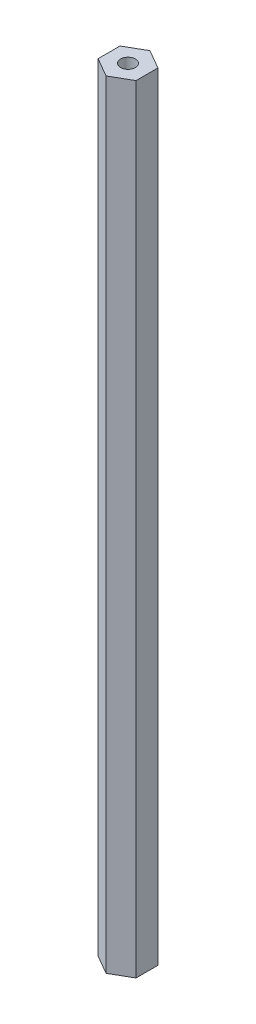
ISO-10303-21;
HEADER;
FILE_DESCRIPTION(('STEP AP214'),'2;1');
FILE_NAME('part.step','',(''),(''),'','','');
FILE_SCHEMA(('AUTOMOTIVE_DESIGN { 1 0 10303 214 1 1 1 1 }'));
ENDSEC;
DATA;
#1=APPLICATION_CONTEXT('core data for automotive mechanical design processes');
#2=APPLICATION_PROTOCOL_DEFINITION('international standard','automotive_design',2000,#1);
#3=PRODUCT_CONTEXT('',#1,'mechanical');
#4=PRODUCT('Part','Part','',(#3));
#5=PRODUCT_RELATED_PRODUCT_CATEGORY('part','',(#4));
#6=PRODUCT_DEFINITION_FORMATION('','',#4);
#7=PRODUCT_DEFINITION_CONTEXT('part definition',#1,'design');
#8=PRODUCT_DEFINITION('design','',#6,#7);
#9=PRODUCT_DEFINITION_SHAPE('','',#8);
#10=(LENGTH_UNIT() NAMED_UNIT(*) SI_UNIT(.MILLI.,.METRE.));
#11=(NAMED_UNIT(*) PLANE_ANGLE_UNIT() SI_UNIT($,.RADIAN.));
#12=(NAMED_UNIT(*) SI_UNIT($,.STERADIAN.) SOLID_ANGLE_UNIT());
#13=UNCERTAINTY_MEASURE_WITH_UNIT(LENGTH_MEASURE(1.E-05),#10,'distance_accuracy_value','');
#14=(GEOMETRIC_REPRESENTATION_CONTEXT(3) GLOBAL_UNCERTAINTY_ASSIGNED_CONTEXT((#13)) GLOBAL_UNIT_ASSIGNED_CONTEXT((#10,
#11,#12)) REPRESENTATION_CONTEXT('',''));
#15=CARTESIAN_POINT('',(0.,0.,0.));
#16=DIRECTION('',(0.,0.,1.));
#17=DIRECTION('',(1.,0.,0.));
#18=AXIS2_PLACEMENT_3D('',#15,#16,#17);
#19=CARTESIAN_POINT('',(-0.00105535641912015,130.,7.33234834275872));
#20=DIRECTION('',(-0.499875346424966,0.,-0.86609736059898));
#21=DIRECTION('',(-0.86609736059898,0.,0.499875346424966));
#22=AXIS2_PLACEMENT_3D('',#19,#20,#21);
#23=PLANE('',#22);
#24=DIRECTION('',(0.86609736059898,0.,-0.499875346424966));
#25=VECTOR('',#24,1.);
#26=CARTESIAN_POINT('',(-0.00105535641912015,-130.,7.33234834275872));
#27=LINE('',#26,#25);
#28=CARTESIAN_POINT('',(-0.00105535641912015,-130.,7.33234834275872));
#29=VERTEX_POINT('',#28);
#30=CARTESIAN_POINT('',(6.34947225601622,-130.,3.66708813684837));
#31=VERTEX_POINT('',#30);
#32=EDGE_CURVE('E124',#29,#31,#27,.T.);
#33=ORIENTED_EDGE('',*,*,#32,.T.);
#34=DIRECTION('',(0.,-1.,0.));
#35=VECTOR('',#34,1.);
#36=CARTESIAN_POINT('',(6.34947225601622,130.,3.66708813684837));
#37=LINE('',#36,#35);
#38=CARTESIAN_POINT('',(6.34947225601622,130.,3.66708813684837));
#39=VERTEX_POINT('',#38);
#40=EDGE_CURVE('E11',#39,#31,#37,.T.);
#41=ORIENTED_EDGE('',*,*,#40,.F.);
#42=DIRECTION('',(0.86609736059898,0.,-0.499875346424966));
#43=VECTOR('',#42,1.);
#44=CARTESIAN_POINT('',(-0.00105535641912015,130.,7.33234834275872));
#45=LINE('',#44,#43);
#46=CARTESIAN_POINT('',(-0.00105535641912015,130.,7.33234834275872));
#47=VERTEX_POINT('',#46);
#48=EDGE_CURVE('E135',#47,#39,#45,.T.);
#49=ORIENTED_EDGE('',*,*,#48,.F.);
#50=DIRECTION('',(0.,-1.,0.));
#51=VECTOR('',#50,1.);
#52=CARTESIAN_POINT('',(-0.00105535641912015,130.,7.33234834275872));
#53=LINE('',#52,#51);
#54=EDGE_CURVE('E120',#47,#29,#53,.T.);
#55=ORIENTED_EDGE('',*,*,#54,.T.);
#56=EDGE_LOOP('',(#33,#41,#49,#55));
#57=FACE_BOUND('',#56,.T.);
#58=ADVANCED_FACE('F37',(#57),#23,.F.);
#59=CARTESIAN_POINT('',(6.34947225601622,130.,3.66708813684837));
#60=DIRECTION('',(-0.999999989641852,0.,-0.000143931569922465));
#61=DIRECTION('',(-0.000143931569922465,0.,0.999999989641852));
#62=AXIS2_PLACEMENT_3D('',#59,#60,#61);
#63=PLANE('',#62);
#64=DIRECTION('',(0.000143931569922465,0.,-0.999999989641852));
#65=VECTOR('',#64,1.);
#66=CARTESIAN_POINT('',(6.34947225601622,-130.,3.66708813684837));
#67=LINE('',#66,#65);
#68=CARTESIAN_POINT('',(6.35052761243534,-130.,-3.66526020591035));
#69=VERTEX_POINT('',#68);
#70=EDGE_CURVE('E127',#31,#69,#67,.T.);
#71=ORIENTED_EDGE('',*,*,#70,.T.);
#72=DIRECTION('',(0.,-1.,0.));
#73=VECTOR('',#72,1.);
#74=CARTESIAN_POINT('',(6.35052761243534,130.,-3.66526020591035));
#75=LINE('',#74,#73);
#76=CARTESIAN_POINT('',(6.35052761243534,130.,-3.66526020591035));
#77=VERTEX_POINT('',#76);
#78=EDGE_CURVE('E45',#77,#69,#75,.T.);
#79=ORIENTED_EDGE('',*,*,#78,.F.);
#80=DIRECTION('',(0.000143931569922465,0.,-0.999999989641852));
#81=VECTOR('',#80,1.);
#82=CARTESIAN_POINT('',(6.34947225601622,130.,3.66708813684837));
#83=LINE('',#82,#81);
#84=EDGE_CURVE('E91',#39,#77,#83,.T.);
#85=ORIENTED_EDGE('',*,*,#84,.F.);
#86=ORIENTED_EDGE('',*,*,#40,.T.);
#87=EDGE_LOOP('',(#71,#79,#85,#86));
#88=FACE_BOUND('',#87,.T.);
#89=ADVANCED_FACE('F161',(#88),#63,.F.);
#90=CARTESIAN_POINT('',(6.35052761243534,130.,-3.66526020591035));
#91=DIRECTION('',(-0.500124643216885,0.,0.865953429029057));
#92=DIRECTION('',(0.865953429029058,0.,0.500124643216886));
#93=AXIS2_PLACEMENT_3D('',#90,#91,#92);
#94=PLANE('',#93);
#95=DIRECTION('',(-0.865953429029058,0.,-0.500124643216885));
#96=VECTOR('',#95,1.);
#97=CARTESIAN_POINT('',(6.35052761243534,-130.,-3.66526020591035));
#98=LINE('',#97,#96);
#99=CARTESIAN_POINT('',(0.00105535641912709,-130.,-7.33234834275872));
#100=VERTEX_POINT('',#99);
#101=EDGE_CURVE('E130',#69,#100,#98,.T.);
#102=ORIENTED_EDGE('',*,*,#101,.T.);
#103=DIRECTION('',(0.,-1.,0.));
#104=VECTOR('',#103,1.);
#105=CARTESIAN_POINT('',(0.00105535641912709,130.,-7.33234834275872));
#106=LINE('',#105,#104);
#107=CARTESIAN_POINT('',(0.00105535641912709,130.,-7.33234834275872));
#108=VERTEX_POINT('',#107);
#109=EDGE_CURVE('E115',#108,#100,#106,.T.);
#110=ORIENTED_EDGE('',*,*,#109,.F.);
#111=DIRECTION('',(-0.865953429029058,0.,-0.500124643216885));
#112=VECTOR('',#111,1.);
#113=CARTESIAN_POINT('',(6.35052761243534,130.,-3.66526020591035));
#114=LINE('',#113,#112);
#115=EDGE_CURVE('E106',#77,#108,#114,.T.);
#116=ORIENTED_EDGE('',*,*,#115,.F.);
#117=ORIENTED_EDGE('',*,*,#78,.T.);
#118=EDGE_LOOP('',(#102,#110,#116,#117));
#119=FACE_BOUND('',#118,.T.);
#120=ADVANCED_FACE('F141',(#119),#94,.F.);
#121=CARTESIAN_POINT('',(0.00105535641912709,130.,-7.33234834275872));
#122=DIRECTION('',(0.499875346424966,0.,0.86609736059898));
#123=DIRECTION('',(0.86609736059898,0.,-0.499875346424966));
#124=AXIS2_PLACEMENT_3D('',#121,#122,#123);
#125=PLANE('',#124);
#126=DIRECTION('',(-0.86609736059898,0.,0.499875346424966));
#127=VECTOR('',#126,1.);
#128=CARTESIAN_POINT('',(0.00105535641912709,-130.,-7.33234834275872));
#129=LINE('',#128,#127);
#130=CARTESIAN_POINT('',(-6.34947225601622,-130.,-3.66708813684837));
#131=VERTEX_POINT('',#130);
#132=EDGE_CURVE('E114',#100,#131,#129,.T.);
#133=ORIENTED_EDGE('',*,*,#132,.T.);
#134=DIRECTION('',(0.,-1.,0.));
#135=VECTOR('',#134,1.);
#136=CARTESIAN_POINT('',(-6.34947225601622,130.,-3.66708813684837));
#137=LINE('',#136,#135);
#138=CARTESIAN_POINT('',(-6.34947225601622,130.,-3.66708813684837));
#139=VERTEX_POINT('',#138);
#140=EDGE_CURVE('E111',#139,#131,#137,.T.);
#141=ORIENTED_EDGE('',*,*,#140,.F.);
#142=DIRECTION('',(-0.86609736059898,0.,0.499875346424966));
#143=VECTOR('',#142,1.);
#144=CARTESIAN_POINT('',(0.00105535641912709,130.,-7.33234834275872));
#145=LINE('',#144,#143);
#146=EDGE_CURVE('E100',#108,#139,#145,.T.);
#147=ORIENTED_EDGE('',*,*,#146,.F.);
#148=ORIENTED_EDGE('',*,*,#109,.T.);
#149=EDGE_LOOP('',(#133,#141,#147,#148));
#150=FACE_BOUND('',#149,.T.);
#151=ADVANCED_FACE('F112',(#150),#125,.F.);
#152=CARTESIAN_POINT('',(-6.34947225601622,130.,-3.66708813684837));
#153=DIRECTION('',(0.999999989641851,0.,0.000143931569922465));
#154=DIRECTION('',(0.000143931569922465,0.,-0.999999989641852));
#155=AXIS2_PLACEMENT_3D('',#152,#153,#154);
#156=PLANE('',#155);
#157=DIRECTION('',(-0.000143931569922465,0.,0.999999989641852));
#158=VECTOR('',#157,1.);
#159=CARTESIAN_POINT('',(-6.34947225601622,-130.,-3.66708813684837));
#160=LINE('',#159,#158);
#161=CARTESIAN_POINT('',(-6.35052761243534,-130.,3.66526020591035));
#162=VERTEX_POINT('',#161);
#163=EDGE_CURVE('E77',#131,#162,#160,.T.);
#164=ORIENTED_EDGE('',*,*,#163,.T.);
#165=DIRECTION('',(0.,-1.,0.));
#166=VECTOR('',#165,1.);
#167=CARTESIAN_POINT('',(-6.35052761243534,130.,3.66526020591035));
#168=LINE('',#167,#166);
#169=CARTESIAN_POINT('',(-6.35052761243534,130.,3.66526020591035));
#170=VERTEX_POINT('',#169);
#171=EDGE_CURVE('E116',#170,#162,#168,.T.);
#172=ORIENTED_EDGE('',*,*,#171,.F.);
#173=DIRECTION('',(-0.000143931569922465,0.,0.999999989641852));
#174=VECTOR('',#173,1.);
#175=CARTESIAN_POINT('',(-6.34947225601622,130.,-3.66708813684837));
#176=LINE('',#175,#174);
#177=EDGE_CURVE('E104',#139,#170,#176,.T.);
#178=ORIENTED_EDGE('',*,*,#177,.F.);
#179=ORIENTED_EDGE('',*,*,#140,.T.);
#180=EDGE_LOOP('',(#164,#172,#178,#179));
#181=FACE_BOUND('',#180,.T.);
#182=ADVANCED_FACE('F118',(#181),#156,.F.);
#183=CARTESIAN_POINT('',(-6.35052761243534,130.,3.66526020591035));
#184=DIRECTION('',(0.500124643216885,0.,-0.865953429029058));
#185=DIRECTION('',(-0.865953429029058,0.,-0.500124643216885));
#186=AXIS2_PLACEMENT_3D('',#183,#184,#185);
#187=PLANE('',#186);
#188=DIRECTION('',(0.865953429029058,0.,0.500124643216885));
#189=VECTOR('',#188,1.);
#190=CARTESIAN_POINT('',(-6.35052761243534,-130.,3.66526020591035));
#191=LINE('',#190,#189);
#192=EDGE_CURVE('E83',#162,#29,#191,.T.);
#193=ORIENTED_EDGE('',*,*,#192,.T.);
#194=ORIENTED_EDGE('',*,*,#54,.F.);
#195=DIRECTION('',(0.865953429029058,0.,0.500124643216885));
#196=VECTOR('',#195,1.);
#197=CARTESIAN_POINT('',(-6.35052761243534,130.,3.66526020591035));
#198=LINE('',#197,#196);
#199=EDGE_CURVE('E53',#170,#47,#198,.T.);
#200=ORIENTED_EDGE('',*,*,#199,.F.);
#201=ORIENTED_EDGE('',*,*,#171,.T.);
#202=EDGE_LOOP('',(#193,#194,#200,#201));
#203=FACE_BOUND('',#202,.T.);
#204=ADVANCED_FACE('F148',(#203),#187,.F.);
#205=CARTESIAN_POINT('',(0.,130.,0.));
#206=DIRECTION('',(0.,1.,0.));
#207=DIRECTION('',(0.,0.,1.));
#208=AXIS2_PLACEMENT_3D('',#205,#206,#207);
#209=PLANE('',#208);
#210=CARTESIAN_POINT('',(0.,130.,0.));
#211=DIRECTION('',(0.,1.,0.));
#212=DIRECTION('',(0.,0.,1.));
#213=AXIS2_PLACEMENT_3D('',#210,#211,#212);
#214=CIRCLE('',#213,2.49999999999999);
#215=CARTESIAN_POINT('',(0.,130.,2.49999999999999));
#216=VERTEX_POINT('',#215);
#217=EDGE_CURVE('E248',#216,#216,#214,.T.);
#218=ORIENTED_EDGE('',*,*,#217,.F.);
#219=EDGE_LOOP('',(#218));
#220=FACE_BOUND('',#219,.T.);
#221=ORIENTED_EDGE('',*,*,#48,.T.);
#222=ORIENTED_EDGE('',*,*,#84,.T.);
#223=ORIENTED_EDGE('',*,*,#115,.T.);
#224=ORIENTED_EDGE('',*,*,#146,.T.);
#225=ORIENTED_EDGE('',*,*,#177,.T.);
#226=ORIENTED_EDGE('',*,*,#199,.T.);
#227=EDGE_LOOP('',(#221,#222,#223,#224,#225,#226));
#228=FACE_BOUND('',#227,.T.);
#229=ADVANCED_FACE('F102',(#220,#228),#209,.T.);
#230=CARTESIAN_POINT('',(0.,-130.,0.));
#231=DIRECTION('',(0.,1.,0.));
#232=DIRECTION('',(0.,0.,1.));
#233=AXIS2_PLACEMENT_3D('',#230,#231,#232);
#234=PLANE('',#233);
#235=CARTESIAN_POINT('',(0.,-130.,0.));
#236=DIRECTION('',(0.,-1.,0.));
#237=DIRECTION('',(0.,0.,-1.));
#238=AXIS2_PLACEMENT_3D('',#235,#236,#237);
#239=CIRCLE('',#238,2.49999999999999);
#240=CARTESIAN_POINT('',(0.,-130.,-2.49999999999999));
#241=VERTEX_POINT('',#240);
#242=EDGE_CURVE('E246',#241,#241,#239,.T.);
#243=ORIENTED_EDGE('',*,*,#242,.F.);
#244=EDGE_LOOP('',(#243));
#245=FACE_BOUND('',#244,.T.);
#246=ORIENTED_EDGE('',*,*,#32,.F.);
#247=ORIENTED_EDGE('',*,*,#192,.F.);
#248=ORIENTED_EDGE('',*,*,#163,.F.);
#249=ORIENTED_EDGE('',*,*,#132,.F.);
#250=ORIENTED_EDGE('',*,*,#101,.F.);
#251=ORIENTED_EDGE('',*,*,#70,.F.);
#252=EDGE_LOOP('',(#246,#247,#248,#249,#250,#251));
#253=FACE_BOUND('',#252,.T.);
#254=ADVANCED_FACE('F144',(#245,#253),#234,.F.);
#255=CARTESIAN_POINT('',(0.,115.,0.));
#256=DIRECTION('',(0.,1.,0.));
#257=DIRECTION('',(0.,0.,1.));
#258=AXIS2_PLACEMENT_3D('',#255,#256,#257);
#259=CONICAL_SURFACE('',#258,2.49999999999999,1.02974425867665);
#260=CARTESIAN_POINT('',(0.,113.497848452431,0.));
#261=VERTEX_POINT('',#260);
#262=VERTEX_LOOP('',#261);
#263=FACE_BOUND('',#262,.T.);
#264=CARTESIAN_POINT('',(0.,115.,0.));
#265=DIRECTION('',(0.,1.,0.));
#266=DIRECTION('',(0.,0.,1.));
#267=AXIS2_PLACEMENT_3D('',#264,#265,#266);
#268=CIRCLE('',#267,2.49999999999999);
#269=CARTESIAN_POINT('',(0.,115.,2.49999999999999));
#270=VERTEX_POINT('',#269);
#271=EDGE_CURVE('E128',#270,#270,#268,.T.);
#272=ORIENTED_EDGE('',*,*,#271,.T.);
#273=EDGE_LOOP('',(#272));
#274=FACE_BOUND('',#273,.T.);
#275=ADVANCED_FACE('F192',(#263,#274),#259,.F.);
#276=CARTESIAN_POINT('',(0.,130.,0.));
#277=DIRECTION('',(0.,1.,0.));
#278=DIRECTION('',(0.,0.,1.));
#279=AXIS2_PLACEMENT_3D('',#276,#277,#278);
#280=CYLINDRICAL_SURFACE('',#279,2.49999999999999);
#281=ORIENTED_EDGE('',*,*,#271,.F.);
#282=EDGE_LOOP('',(#281));
#283=FACE_BOUND('',#282,.T.);
#284=ORIENTED_EDGE('',*,*,#217,.T.);
#285=EDGE_LOOP('',(#284));
#286=FACE_BOUND('',#285,.T.);
#287=ADVANCED_FACE('F197',(#283,#286),#280,.F.);
#288=CARTESIAN_POINT('',(0.,-115.,0.));
#289=DIRECTION('',(0.,-1.,0.));
#290=DIRECTION('',(0.,0.,-1.));
#291=AXIS2_PLACEMENT_3D('',#288,#289,#290);
#292=CONICAL_SURFACE('',#291,2.49999999999999,1.02974425867665);
#293=CARTESIAN_POINT('',(0.,-113.497848452431,0.));
#294=VERTEX_POINT('',#293);
#295=VERTEX_LOOP('',#294);
#296=FACE_BOUND('',#295,.T.);
#297=CARTESIAN_POINT('',(0.,-115.,0.));
#298=DIRECTION('',(0.,-1.,0.));
#299=DIRECTION('',(0.,0.,-1.));
#300=AXIS2_PLACEMENT_3D('',#297,#298,#299);
#301=CIRCLE('',#300,2.49999999999999);
#302=CARTESIAN_POINT('',(0.,-115.,-2.49999999999999));
#303=VERTEX_POINT('',#302);
#304=EDGE_CURVE('E243',#303,#303,#301,.T.);
#305=ORIENTED_EDGE('',*,*,#304,.T.);
#306=EDGE_LOOP('',(#305));
#307=FACE_BOUND('',#306,.T.);
#308=ADVANCED_FACE('F209',(#296,#307),#292,.F.);
#309=CARTESIAN_POINT('',(0.,-130.,0.));
#310=DIRECTION('',(0.,-1.,0.));
#311=DIRECTION('',(0.,0.,-1.));
#312=AXIS2_PLACEMENT_3D('',#309,#310,#311);
#313=CYLINDRICAL_SURFACE('',#312,2.49999999999999);
#314=ORIENTED_EDGE('',*,*,#304,.F.);
#315=EDGE_LOOP('',(#314));
#316=FACE_BOUND('',#315,.T.);
#317=ORIENTED_EDGE('',*,*,#242,.T.);
#318=EDGE_LOOP('',(#317));
#319=FACE_BOUND('',#318,.T.);
#320=ADVANCED_FACE('F225',(#316,#319),#313,.F.);
#321=CLOSED_SHELL('',(#58,#89,#120,#151,#182,#204,#229,#254,#275,#287,#308,#320));
#322=MANIFOLD_SOLID_BREP('B2',#321);
#323=ADVANCED_BREP_SHAPE_REPRESENTATION('',(#18,#322),#14);
#324=SHAPE_DEFINITION_REPRESENTATION(#9,#323);
ENDSEC;
END-ISO-10303-21;
